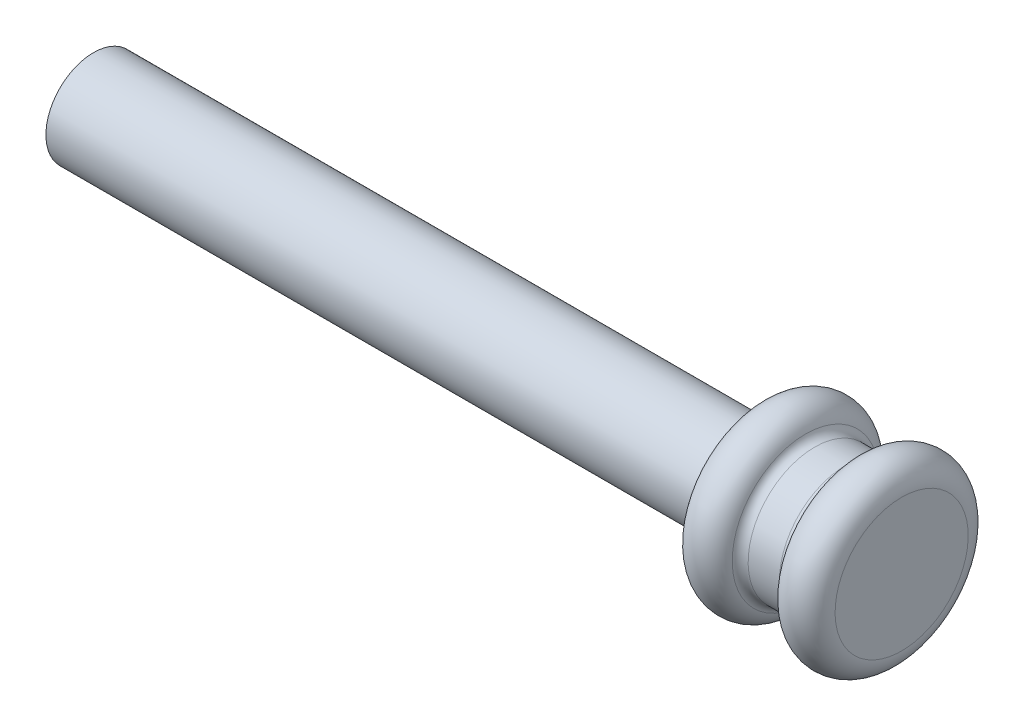
ISO-10303-21;
HEADER;
FILE_DESCRIPTION(('STEP AP214'),'2;1');
FILE_NAME('part.step','',(''),(''),'','','');
FILE_SCHEMA(('AUTOMOTIVE_DESIGN { 1 0 10303 214 1 1 1 1 }'));
ENDSEC;
DATA;
#1=APPLICATION_CONTEXT('core data for automotive mechanical design processes');
#2=APPLICATION_PROTOCOL_DEFINITION('international standard','automotive_design',2000,#1);
#3=PRODUCT_CONTEXT('',#1,'mechanical');
#4=PRODUCT('Part','Part','',(#3));
#5=PRODUCT_RELATED_PRODUCT_CATEGORY('part','',(#4));
#6=PRODUCT_DEFINITION_FORMATION('','',#4);
#7=PRODUCT_DEFINITION_CONTEXT('part definition',#1,'design');
#8=PRODUCT_DEFINITION('design','',#6,#7);
#9=PRODUCT_DEFINITION_SHAPE('','',#8);
#10=(LENGTH_UNIT() NAMED_UNIT(*) SI_UNIT(.MILLI.,.METRE.));
#11=(NAMED_UNIT(*) PLANE_ANGLE_UNIT() SI_UNIT($,.RADIAN.));
#12=(NAMED_UNIT(*) SI_UNIT($,.STERADIAN.) SOLID_ANGLE_UNIT());
#13=UNCERTAINTY_MEASURE_WITH_UNIT(LENGTH_MEASURE(1.E-05),#10,'distance_accuracy_value','');
#14=(GEOMETRIC_REPRESENTATION_CONTEXT(3) GLOBAL_UNCERTAINTY_ASSIGNED_CONTEXT((#13)) GLOBAL_UNIT_ASSIGNED_CONTEXT((#10,
#11,#12)) REPRESENTATION_CONTEXT('',''));
#15=CARTESIAN_POINT('',(0.,0.,0.));
#16=DIRECTION('',(0.,0.,1.));
#17=DIRECTION('',(1.,0.,0.));
#18=AXIS2_PLACEMENT_3D('',#15,#16,#17);
#19=CARTESIAN_POINT('',(3.90625000000004,-7.,0.));
#20=DIRECTION('',(1.,0.,0.));
#21=DIRECTION('',(0.,1.,0.));
#22=AXIS2_PLACEMENT_3D('',#19,#20,#21);
#23=TOROIDAL_SURFACE('',#22,7.,2.5);
#24=CARTESIAN_POINT('',(1.51046288125027,-7.,0.));
#25=DIRECTION('',(1.,0.,0.));
#26=DIRECTION('',(0.,1.,0.));
#27=AXIS2_PLACEMENT_3D('',#24,#25,#26);
#28=CIRCLE('',#27,7.71428571428571);
#29=CARTESIAN_POINT('',(1.51046288125027,0.714285714285714,0.));
#30=VERTEX_POINT('',#29);
#31=EDGE_CURVE('E10',#30,#30,#28,.T.);
#32=ORIENTED_EDGE('',*,*,#31,.T.);
#33=EDGE_LOOP('',(#32));
#34=FACE_BOUND('',#33,.T.);
#35=CARTESIAN_POINT('',(6.40625000000004,-7.,0.));
#36=DIRECTION('',(1.,0.,0.));
#37=DIRECTION('',(0.,1.,0.));
#38=AXIS2_PLACEMENT_3D('',#35,#36,#37);
#39=CIRCLE('',#38,7.);
#40=CARTESIAN_POINT('',(6.40625000000004,0.,0.));
#41=VERTEX_POINT('',#40);
#42=EDGE_CURVE('E55',#41,#41,#39,.T.);
#43=ORIENTED_EDGE('',*,*,#42,.F.);
#44=EDGE_LOOP('',(#43));
#45=FACE_BOUND('',#44,.T.);
#46=ADVANCED_FACE('F33',(#34,#45),#23,.T.);
#47=CARTESIAN_POINT('',(0.552148033750357,-7.,0.));
#48=DIRECTION('',(1.,0.,0.));
#49=DIRECTION('',(0.,1.,0.));
#50=AXIS2_PLACEMENT_3D('',#47,#48,#49);
#51=TOROIDAL_SURFACE('',#50,8.,1.);
#52=CARTESIAN_POINT('',(0.552148033750357,-7.,0.));
#53=DIRECTION('',(1.,0.,0.));
#54=DIRECTION('',(0.,1.,0.));
#55=AXIS2_PLACEMENT_3D('',#52,#53,#54);
#56=CIRCLE('',#55,7.);
#57=CARTESIAN_POINT('',(0.552148033750357,0.,0.));
#58=VERTEX_POINT('',#57);
#59=EDGE_CURVE('E39',#58,#58,#56,.T.);
#60=ORIENTED_EDGE('',*,*,#59,.T.);
#61=EDGE_LOOP('',(#60));
#62=FACE_BOUND('',#61,.T.);
#63=ORIENTED_EDGE('',*,*,#31,.F.);
#64=EDGE_LOOP('',(#63));
#65=FACE_BOUND('',#64,.T.);
#66=ADVANCED_FACE('F77',(#62,#65),#51,.F.);
#67=CARTESIAN_POINT('',(11.0356450080218,-7.,0.));
#68=DIRECTION('',(1.,0.,0.));
#69=DIRECTION('',(0.,1.,0.));
#70=AXIS2_PLACEMENT_3D('',#67,#68,#69);
#71=CYLINDRICAL_SURFACE('',#70,7.);
#72=ORIENTED_EDGE('',*,*,#59,.F.);
#73=EDGE_LOOP('',(#72));
#74=FACE_BOUND('',#73,.T.);
#75=CARTESIAN_POINT('',(-2.73964803375028,-7.,0.));
#76=DIRECTION('',(1.,0.,0.));
#77=DIRECTION('',(0.,1.,0.));
#78=AXIS2_PLACEMENT_3D('',#75,#76,#77);
#79=CIRCLE('',#78,7.);
#80=CARTESIAN_POINT('',(-2.73964803375028,0.,0.));
#81=VERTEX_POINT('',#80);
#82=EDGE_CURVE('E43',#81,#81,#79,.T.);
#83=ORIENTED_EDGE('',*,*,#82,.T.);
#84=EDGE_LOOP('',(#83));
#85=FACE_BOUND('',#84,.T.);
#86=ADVANCED_FACE('F81',(#74,#85),#71,.T.);
#87=CARTESIAN_POINT('',(-2.73964803375028,-7.,0.));
#88=DIRECTION('',(1.,0.,0.));
#89=DIRECTION('',(0.,1.,0.));
#90=AXIS2_PLACEMENT_3D('',#87,#88,#89);
#91=TOROIDAL_SURFACE('',#90,8.,1.);
#92=CARTESIAN_POINT('',(-3.69796288125018,-7.,0.));
#93=DIRECTION('',(1.,0.,0.));
#94=DIRECTION('',(0.,1.,0.));
#95=AXIS2_PLACEMENT_3D('',#92,#93,#94);
#96=CIRCLE('',#95,7.71428571428571);
#97=CARTESIAN_POINT('',(-3.69796288125019,0.714285714285714,0.));
#98=VERTEX_POINT('',#97);
#99=EDGE_CURVE('E47',#98,#98,#96,.T.);
#100=ORIENTED_EDGE('',*,*,#99,.T.);
#101=EDGE_LOOP('',(#100));
#102=FACE_BOUND('',#101,.T.);
#103=ORIENTED_EDGE('',*,*,#82,.F.);
#104=EDGE_LOOP('',(#103));
#105=FACE_BOUND('',#104,.T.);
#106=ADVANCED_FACE('F97',(#102,#105),#91,.F.);
#107=CARTESIAN_POINT('',(-6.09374999999996,-7.,0.));
#108=DIRECTION('',(1.,0.,0.));
#109=DIRECTION('',(0.,1.,0.));
#110=AXIS2_PLACEMENT_3D('',#107,#108,#109);
#111=TOROIDAL_SURFACE('',#110,7.,2.5);
#112=CARTESIAN_POINT('',(-8.59374999999996,-7.,0.));
#113=DIRECTION('',(1.,0.,0.));
#114=DIRECTION('',(0.,1.,0.));
#115=AXIS2_PLACEMENT_3D('',#112,#113,#114);
#116=CIRCLE('',#115,7.);
#117=CARTESIAN_POINT('',(-8.59374999999996,0.,0.));
#118=VERTEX_POINT('',#117);
#119=EDGE_CURVE('E52',#118,#118,#116,.T.);
#120=ORIENTED_EDGE('',*,*,#119,.T.);
#121=EDGE_LOOP('',(#120));
#122=FACE_BOUND('',#121,.T.);
#123=ORIENTED_EDGE('',*,*,#99,.F.);
#124=EDGE_LOOP('',(#123));
#125=FACE_BOUND('',#124,.T.);
#126=ADVANCED_FACE('F91',(#122,#125),#111,.T.);
#127=CARTESIAN_POINT('',(-8.59374999999996,0.,0.));
#128=DIRECTION('',(-1.,0.,0.));
#129=DIRECTION('',(0.,-1.,0.));
#130=AXIS2_PLACEMENT_3D('',#127,#128,#129);
#131=PLANE('',#130);
#132=CARTESIAN_POINT('',(-8.59374999999996,-7.,0.));
#133=DIRECTION('',(-1.,0.,0.));
#134=DIRECTION('',(0.,-1.,0.));
#135=AXIS2_PLACEMENT_3D('',#132,#133,#134);
#136=CIRCLE('',#135,5.);
#137=CARTESIAN_POINT('',(-8.59374999999996,-12.,0.));
#138=VERTEX_POINT('',#137);
#139=EDGE_CURVE('E58',#138,#138,#136,.T.);
#140=ORIENTED_EDGE('',*,*,#139,.F.);
#141=EDGE_LOOP('',(#140));
#142=FACE_BOUND('',#141,.T.);
#143=ORIENTED_EDGE('',*,*,#119,.F.);
#144=EDGE_LOOP('',(#143));
#145=FACE_BOUND('',#144,.T.);
#146=ADVANCED_FACE('F86',(#142,#145),#131,.T.);
#147=CARTESIAN_POINT('',(6.40625000000004,0.,0.));
#148=DIRECTION('',(1.,0.,0.));
#149=DIRECTION('',(0.,1.,0.));
#150=AXIS2_PLACEMENT_3D('',#147,#148,#149);
#151=PLANE('',#150);
#152=ORIENTED_EDGE('',*,*,#42,.T.);
#153=EDGE_LOOP('',(#152));
#154=FACE_BOUND('',#153,.T.);
#155=ADVANCED_FACE('F73',(#154),#151,.T.);
#156=CARTESIAN_POINT('',(-78.59375,-7.,0.));
#157=DIRECTION('',(1.,0.,0.));
#158=DIRECTION('',(0.,1.,0.));
#159=AXIS2_PLACEMENT_3D('',#156,#157,#158);
#160=CYLINDRICAL_SURFACE('',#159,5.);
#161=ORIENTED_EDGE('',*,*,#139,.T.);
#162=EDGE_LOOP('',(#161));
#163=FACE_BOUND('',#162,.T.);
#164=CARTESIAN_POINT('',(-78.59375,-7.,0.));
#165=DIRECTION('',(1.,0.,0.));
#166=DIRECTION('',(0.,0.,-1.));
#167=AXIS2_PLACEMENT_3D('',#164,#165,#166);
#168=CIRCLE('',#167,5.);
#169=CARTESIAN_POINT('',(-78.59375,-7.,-5.));
#170=VERTEX_POINT('',#169);
#171=EDGE_CURVE('E61',#170,#170,#168,.T.);
#172=ORIENTED_EDGE('',*,*,#171,.T.);
#173=EDGE_LOOP('',(#172));
#174=FACE_BOUND('',#173,.T.);
#175=ADVANCED_FACE('F65',(#163,#174),#160,.T.);
#176=CARTESIAN_POINT('',(-78.59375,-7.,0.));
#177=DIRECTION('',(1.,0.,0.));
#178=DIRECTION('',(0.,0.,-1.));
#179=AXIS2_PLACEMENT_3D('',#176,#177,#178);
#180=PLANE('',#179);
#181=ORIENTED_EDGE('',*,*,#171,.F.);
#182=EDGE_LOOP('',(#181));
#183=FACE_BOUND('',#182,.T.);
#184=ADVANCED_FACE('F67',(#183),#180,.F.);
#185=CLOSED_SHELL('',(#46,#66,#86,#106,#126,#146,#155,#175,#184));
#186=MANIFOLD_SOLID_BREP('B2',#185);
#187=ADVANCED_BREP_SHAPE_REPRESENTATION('',(#18,#186),#14);
#188=SHAPE_DEFINITION_REPRESENTATION(#9,#187);
ENDSEC;
END-ISO-10303-21;
